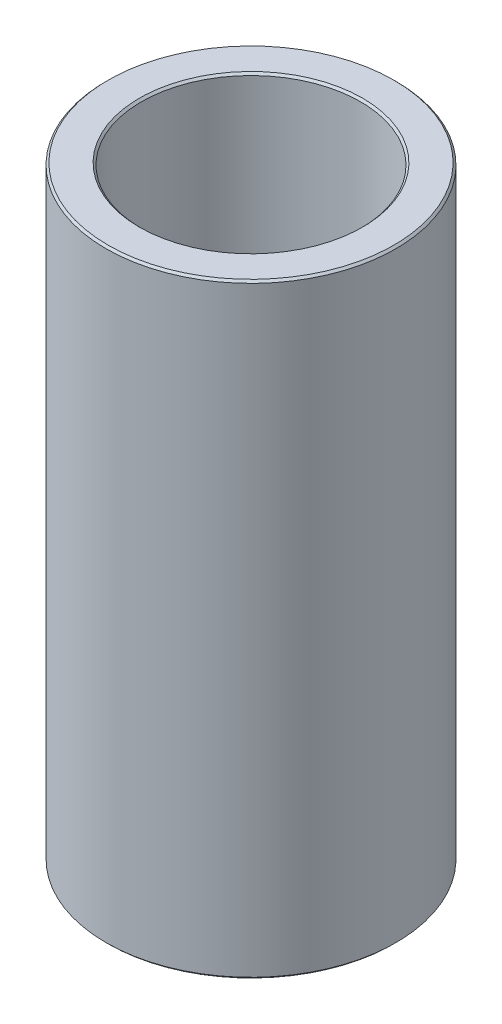
ISO-10303-21;
HEADER;
FILE_DESCRIPTION(('STEP AP214'),'2;1');
FILE_NAME('part.step','',(''),(''),'','','');
FILE_SCHEMA(('AUTOMOTIVE_DESIGN { 1 0 10303 214 1 1 1 1 }'));
ENDSEC;
DATA;
#1=APPLICATION_CONTEXT('core data for automotive mechanical design processes');
#2=APPLICATION_PROTOCOL_DEFINITION('international standard','automotive_design',2000,#1);
#3=PRODUCT_CONTEXT('',#1,'mechanical');
#4=PRODUCT('Part','Part','',(#3));
#5=PRODUCT_RELATED_PRODUCT_CATEGORY('part','',(#4));
#6=PRODUCT_DEFINITION_FORMATION('','',#4);
#7=PRODUCT_DEFINITION_CONTEXT('part definition',#1,'design');
#8=PRODUCT_DEFINITION('design','',#6,#7);
#9=PRODUCT_DEFINITION_SHAPE('','',#8);
#10=(LENGTH_UNIT() NAMED_UNIT(*) SI_UNIT(.MILLI.,.METRE.));
#11=(NAMED_UNIT(*) PLANE_ANGLE_UNIT() SI_UNIT($,.RADIAN.));
#12=(NAMED_UNIT(*) SI_UNIT($,.STERADIAN.) SOLID_ANGLE_UNIT());
#13=UNCERTAINTY_MEASURE_WITH_UNIT(LENGTH_MEASURE(1.E-05),#10,'distance_accuracy_value','');
#14=(GEOMETRIC_REPRESENTATION_CONTEXT(3) GLOBAL_UNCERTAINTY_ASSIGNED_CONTEXT((#13)) GLOBAL_UNIT_ASSIGNED_CONTEXT((#10,
#11,#12)) REPRESENTATION_CONTEXT('',''));
#15=CARTESIAN_POINT('',(0.,0.,0.));
#16=DIRECTION('',(0.,0.,1.));
#17=DIRECTION('',(1.,0.,0.));
#18=AXIS2_PLACEMENT_3D('',#15,#16,#17);
#19=CARTESIAN_POINT('',(0.,219.13131283102,0.));
#20=DIRECTION('',(0.,-1.,0.));
#21=DIRECTION('',(0.,0.,-1.));
#22=AXIS2_PLACEMENT_3D('',#19,#20,#21);
#23=CYLINDRICAL_SURFACE('',#22,52.5);
#24=CARTESIAN_POINT('',(0.,0.743105318616905,0.));
#25=DIRECTION('',(0.,1.,0.));
#26=DIRECTION('',(0.,0.,1.));
#27=AXIS2_PLACEMENT_3D('',#24,#25,#26);
#28=CIRCLE('',#27,52.5);
#29=CARTESIAN_POINT('',(0.,0.743105318616905,52.5));
#30=VERTEX_POINT('',#29);
#31=EDGE_CURVE('E10',#30,#30,#28,.T.);
#32=ORIENTED_EDGE('',*,*,#31,.T.);
#33=EDGE_LOOP('',(#32));
#34=FACE_BOUND('',#33,.T.);
#35=CARTESIAN_POINT('',(0.,218.388207512403,0.));
#36=DIRECTION('',(0.,1.,0.));
#37=DIRECTION('',(0.,0.,1.));
#38=AXIS2_PLACEMENT_3D('',#35,#36,#37);
#39=CIRCLE('',#38,52.5);
#40=CARTESIAN_POINT('',(0.,218.388207512403,-52.5));
#41=VERTEX_POINT('',#40);
#42=EDGE_CURVE('E50',#41,#41,#39,.F.);
#43=ORIENTED_EDGE('',*,*,#42,.T.);
#44=EDGE_LOOP('',(#43));
#45=FACE_BOUND('',#44,.T.);
#46=ADVANCED_FACE('F39',(#34,#45),#23,.T.);
#47=CARTESIAN_POINT('',(0.,219.13131283102,0.));
#48=DIRECTION('',(0.,1.,0.));
#49=DIRECTION('',(0.,0.,1.));
#50=AXIS2_PLACEMENT_3D('',#47,#48,#49);
#51=PLANE('',#50);
#52=CARTESIAN_POINT('',(0.,219.13131283102,0.));
#53=DIRECTION('',(0.,1.,0.));
#54=DIRECTION('',(0.,0.,1.));
#55=AXIS2_PLACEMENT_3D('',#52,#53,#54);
#56=CIRCLE('',#55,40.4467173957197);
#57=CARTESIAN_POINT('',(0.,219.13131283102,40.4467173957197));
#58=VERTEX_POINT('',#57);
#59=EDGE_CURVE('E58',#58,#58,#56,.F.);
#60=ORIENTED_EDGE('',*,*,#59,.T.);
#61=EDGE_LOOP('',(#60));
#62=FACE_BOUND('',#61,.T.);
#63=CARTESIAN_POINT('',(0.,219.13131283102,0.));
#64=DIRECTION('',(0.,1.,0.));
#65=DIRECTION('',(0.,0.,1.));
#66=AXIS2_PLACEMENT_3D('',#63,#64,#65);
#67=CIRCLE('',#66,51.7568946813831);
#68=CARTESIAN_POINT('',(0.,219.13131283102,-51.7568946813831));
#69=VERTEX_POINT('',#68);
#70=EDGE_CURVE('E61',#69,#69,#67,.T.);
#71=ORIENTED_EDGE('',*,*,#70,.T.);
#72=EDGE_LOOP('',(#71));
#73=FACE_BOUND('',#72,.T.);
#74=ADVANCED_FACE('F88',(#62,#73),#51,.T.);
#75=CARTESIAN_POINT('',(0.,0.,0.));
#76=DIRECTION('',(0.,1.,0.));
#77=DIRECTION('',(0.,0.,1.));
#78=AXIS2_PLACEMENT_3D('',#75,#76,#77);
#79=PLANE('',#78);
#80=CARTESIAN_POINT('',(0.,0.,0.));
#81=DIRECTION('',(0.,1.,0.));
#82=DIRECTION('',(0.,0.,1.));
#83=AXIS2_PLACEMENT_3D('',#80,#81,#82);
#84=CIRCLE('',#83,40.4467173957197);
#85=CARTESIAN_POINT('',(0.,0.,40.4467173957197));
#86=VERTEX_POINT('',#85);
#87=EDGE_CURVE('E51',#86,#86,#84,.T.);
#88=ORIENTED_EDGE('',*,*,#87,.T.);
#89=EDGE_LOOP('',(#88));
#90=FACE_BOUND('',#89,.T.);
#91=CARTESIAN_POINT('',(0.,0.,0.));
#92=DIRECTION('',(0.,1.,0.));
#93=DIRECTION('',(0.,0.,1.));
#94=AXIS2_PLACEMENT_3D('',#91,#92,#93);
#95=CIRCLE('',#94,51.7568946813831);
#96=CARTESIAN_POINT('',(0.,0.,51.7568946813831));
#97=VERTEX_POINT('',#96);
#98=EDGE_CURVE('E54',#97,#97,#95,.F.);
#99=ORIENTED_EDGE('',*,*,#98,.T.);
#100=EDGE_LOOP('',(#99));
#101=FACE_BOUND('',#100,.T.);
#102=ADVANCED_FACE('F83',(#90,#101),#79,.F.);
#103=CARTESIAN_POINT('',(0.,219.13131283102,0.));
#104=DIRECTION('',(0.,-1.,0.));
#105=DIRECTION('',(0.,0.,-1.));
#106=AXIS2_PLACEMENT_3D('',#103,#104,#105);
#107=CYLINDRICAL_SURFACE('',#106,39.7036120771028);
#108=CARTESIAN_POINT('',(0.,218.388207512403,0.));
#109=DIRECTION('',(0.,1.,0.));
#110=DIRECTION('',(0.,0.,1.));
#111=AXIS2_PLACEMENT_3D('',#108,#109,#110);
#112=CIRCLE('',#111,39.7036120771028);
#113=CARTESIAN_POINT('',(0.,218.388207512403,39.7036120771028));
#114=VERTEX_POINT('',#113);
#115=EDGE_CURVE('E67',#114,#114,#112,.T.);
#116=ORIENTED_EDGE('',*,*,#115,.T.);
#117=EDGE_LOOP('',(#116));
#118=FACE_BOUND('',#117,.T.);
#119=CARTESIAN_POINT('',(0.,0.743105318616905,0.));
#120=DIRECTION('',(0.,1.,0.));
#121=DIRECTION('',(0.,0.,1.));
#122=AXIS2_PLACEMENT_3D('',#119,#120,#121);
#123=CIRCLE('',#122,39.7036120771028);
#124=CARTESIAN_POINT('',(0.,0.743105318616905,39.7036120771028));
#125=VERTEX_POINT('',#124);
#126=EDGE_CURVE('E69',#125,#125,#123,.F.);
#127=ORIENTED_EDGE('',*,*,#126,.T.);
#128=EDGE_LOOP('',(#127));
#129=FACE_BOUND('',#128,.T.);
#130=ADVANCED_FACE('F71',(#118,#129),#107,.F.);
#131=CARTESIAN_POINT('',(0.,218.388207512403,0.));
#132=DIRECTION('',(0.,1.,0.));
#133=DIRECTION('',(0.,0.,1.));
#134=AXIS2_PLACEMENT_3D('',#131,#132,#133);
#135=CONICAL_SURFACE('',#134,39.7036120771028,0.785398163397453);
#136=CARTESIAN_POINT('',(0.,219.13131283102,40.4467173957197));
#137=CARTESIAN_POINT('',(0.,219.123572150618,40.4389767153174));
#138=CARTESIAN_POINT('',(0.,219.115831470216,40.4312360349152));
#139=CARTESIAN_POINT('',(0.,219.100350109411,40.4157546741106));
#140=CARTESIAN_POINT('',(0.,219.092609429009,40.4080139937084));
#141=CARTESIAN_POINT('',(0.,219.077128068204,40.3925326329039));
#142=CARTESIAN_POINT('',(0.,219.069387387802,40.3847919525016));
#143=CARTESIAN_POINT('',(0.,219.053906026998,40.3693105916971));
#144=CARTESIAN_POINT('',(0.,219.046165346595,40.3615699112948));
#145=CARTESIAN_POINT('',(0.,219.030683985791,40.3460885504903));
#146=CARTESIAN_POINT('',(0.,219.022943305389,40.3383478700881));
#147=CARTESIAN_POINT('',(0.,219.007461944584,40.3228665092835));
#148=CARTESIAN_POINT('',(0.,218.999721264182,40.3151258288813));
#149=CARTESIAN_POINT('',(0.,218.984239903377,40.2996444680768));
#150=CARTESIAN_POINT('',(0.,218.976499222975,40.2919037876745));
#151=CARTESIAN_POINT('',(0.,218.96101786217,40.27642242687));
#152=CARTESIAN_POINT('',(0.,218.953277181768,40.2686817464677));
#153=CARTESIAN_POINT('',(0.,218.937795820964,40.2532003856632));
#154=CARTESIAN_POINT('',(0.,218.930055140561,40.2454597052609));
#155=CARTESIAN_POINT('',(0.,218.914573779757,40.2299783444564));
#156=CARTESIAN_POINT('',(0.,218.906833099355,40.2222376640542));
#157=CARTESIAN_POINT('',(0.,218.89135173855,40.2067563032496));
#158=CARTESIAN_POINT('',(0.,218.883611058148,40.1990156228474));
#159=CARTESIAN_POINT('',(0.,218.868129697343,40.1835342620429));
#160=CARTESIAN_POINT('',(0.,218.860389016941,40.1757935816406));
#161=CARTESIAN_POINT('',(0.,218.844907656137,40.1603122208361));
#162=CARTESIAN_POINT('',(0.,218.837166975734,40.1525715404338));
#163=CARTESIAN_POINT('',(0.,218.82168561493,40.1370901796293));
#164=CARTESIAN_POINT('',(0.,218.813944934528,40.1293494992271));
#165=CARTESIAN_POINT('',(0.,218.798463573723,40.1138681384225));
#166=CARTESIAN_POINT('',(0.,218.790722893321,40.1061274580203));
#167=CARTESIAN_POINT('',(0.,218.775241532516,40.0906460972158));
#168=CARTESIAN_POINT('',(0.,218.767500852114,40.0829054168135));
#169=CARTESIAN_POINT('',(0.,218.752019491309,40.067424056009));
#170=CARTESIAN_POINT('',(0.,218.744278810907,40.0596833756067));
#171=CARTESIAN_POINT('',(0.,218.728797450103,40.0442020148022));
#172=CARTESIAN_POINT('',(0.,218.7210567697,40.0364613343999));
#173=CARTESIAN_POINT('',(0.,218.705575408896,40.0209799735954));
#174=CARTESIAN_POINT('',(0.,218.697834728494,40.0132392931932));
#175=CARTESIAN_POINT('',(0.,218.682353367689,39.9977579323886));
#176=CARTESIAN_POINT('',(0.,218.674612687287,39.9900172519864));
#177=CARTESIAN_POINT('',(0.,218.659131326482,39.9745358911819));
#178=CARTESIAN_POINT('',(0.,218.65139064608,39.9667952107796));
#179=CARTESIAN_POINT('',(0.,218.635909285276,39.9513138499751));
#180=CARTESIAN_POINT('',(0.,218.628168604873,39.9435731695728));
#181=CARTESIAN_POINT('',(0.,218.612687244069,39.9280918087683));
#182=CARTESIAN_POINT('',(0.,218.604946563667,39.9203511283661));
#183=CARTESIAN_POINT('',(0.,218.589465202862,39.9048697675615));
#184=CARTESIAN_POINT('',(0.,218.58172452246,39.8971290871593));
#185=CARTESIAN_POINT('',(0.,218.566243161655,39.8816477263548));
#186=CARTESIAN_POINT('',(0.,218.558502481253,39.8739070459525));
#187=CARTESIAN_POINT('',(0.,218.543021120448,39.858425685148));
#188=CARTESIAN_POINT('',(0.,218.535280440046,39.8506850047457));
#189=CARTESIAN_POINT('',(0.,218.519799079242,39.8352036439412));
#190=CARTESIAN_POINT('',(0.,218.512058398839,39.8274629635389));
#191=CARTESIAN_POINT('',(0.,218.496577038035,39.8119816027344));
#192=CARTESIAN_POINT('',(0.,218.488836357633,39.8042409223322));
#193=CARTESIAN_POINT('',(0.,218.473354996828,39.7887595615276));
#194=CARTESIAN_POINT('',(0.,218.465614316426,39.7810188811254));
#195=CARTESIAN_POINT('',(0.,218.450132955621,39.7655375203209));
#196=CARTESIAN_POINT('',(0.,218.442392275219,39.7577968399186));
#197=CARTESIAN_POINT('',(0.,218.426910914415,39.7423154791141));
#198=CARTESIAN_POINT('',(0.,218.419170234012,39.7345747987118));
#199=CARTESIAN_POINT('',(0.,218.403688873208,39.7190934379073));
#200=CARTESIAN_POINT('',(0.,218.395948192806,39.7113527575051));
#201=CARTESIAN_POINT('',(0.,218.388207512403,39.7036120771028));
#202=B_SPLINE_CURVE_WITH_KNOTS('',3,(#136,#137,#138,#139,#140,#141,#142,#143,#144,#145,#146,
#147,#148,#149,#150,#151,#152,#153,#154,#155,#156,#157,#158,#159,#160,#161,#162,#163,#164,#165,
#166,#167,#168,#169,#170,#171,#172,#173,#174,#175,#176,#177,#178,#179,#180,#181,#182,#183,#184,
#185,#186,#187,#188,#189,#190,#191,#192,#193,#194,#195,#196,#197,#198,#199,#200,#201),
.UNSPECIFIED.,.F.,.F.,(4,2,2,2,2,2,2,2,2,2,2,2,2,2,2,2,2,2,2,2,2,2,2,2,2,2,2,2,2,2,2,2,4),(0.,
0.0328409256206115,0.0656818512412229,0.0985227768618344,0.131363702482446,0.164204628103057,
0.197045553723669,0.22988647934428,0.262727404964892,0.295568330585503,0.328409256206115,
0.361250181826726,0.394091107447338,0.426932033067949,0.459772958688561,0.492613884309172,
0.525454809929784,0.5582957355504,0.591136661171011,0.623977586791623,0.656818512412234,
0.689659438032846,0.722500363653457,0.755341289274069,0.78818221489468,0.821023140515291,
0.853864066135903,0.886704991756514,0.919545917377126,0.952386842997737,0.985227768618349,
1.01806869423896,1.05090961985955),.UNSPECIFIED.);
#203=EDGE_CURVE('BSEAM77',#58,#114,#202,.T.);
#204=ORIENTED_EDGE('',*,*,#59,.F.);
#205=ORIENTED_EDGE('',*,*,#115,.F.);
#206=ORIENTED_EDGE('',*,*,#203,.T.);
#207=ORIENTED_EDGE('',*,*,#203,.F.);
#208=EDGE_LOOP('',(#204,#206,#205,#207));
#209=FACE_BOUND('',#208,.T.);
#210=ADVANCED_FACE('F77',(#209),#135,.F.);
#211=CARTESIAN_POINT('',(0.,0.,0.));
#212=DIRECTION('',(0.,-1.,0.));
#213=DIRECTION('',(0.,0.,-1.));
#214=AXIS2_PLACEMENT_3D('',#211,#212,#213);
#215=CONICAL_SURFACE('',#214,40.4467173957197,0.785398163397453);
#216=ORIENTED_EDGE('',*,*,#126,.F.);
#217=EDGE_LOOP('',(#216));
#218=FACE_BOUND('',#217,.T.);
#219=ORIENTED_EDGE('',*,*,#87,.F.);
#220=EDGE_LOOP('',(#219));
#221=FACE_BOUND('',#220,.T.);
#222=ADVANCED_FACE('F73',(#218,#221),#215,.F.);
#223=CARTESIAN_POINT('',(0.,0.743105318616905,0.));
#224=DIRECTION('',(0.,1.,0.));
#225=DIRECTION('',(0.,0.,1.));
#226=AXIS2_PLACEMENT_3D('',#223,#224,#225);
#227=CONICAL_SURFACE('',#226,52.5,0.785398163397434);
#228=ORIENTED_EDGE('',*,*,#98,.F.);
#229=EDGE_LOOP('',(#228));
#230=FACE_BOUND('',#229,.T.);
#231=ORIENTED_EDGE('',*,*,#31,.F.);
#232=EDGE_LOOP('',(#231));
#233=FACE_BOUND('',#232,.T.);
#234=ADVANCED_FACE('F76',(#230,#233),#227,.T.);
#235=CARTESIAN_POINT('',(0.,219.13131283102,0.));
#236=DIRECTION('',(0.,-1.,0.));
#237=DIRECTION('',(0.,0.,-1.));
#238=AXIS2_PLACEMENT_3D('',#235,#236,#237);
#239=CONICAL_SURFACE('',#238,51.7568946813831,0.785398163397448);
#240=CARTESIAN_POINT('',(0.,218.388207512403,-52.5));
#241=CARTESIAN_POINT('',(0.,218.395948192806,-52.4922593195977));
#242=CARTESIAN_POINT('',(0.,218.403688873208,-52.4845186391955));
#243=CARTESIAN_POINT('',(0.,218.419170234012,-52.469037278391));
#244=CARTESIAN_POINT('',(0.,218.426910914415,-52.4612965979887));
#245=CARTESIAN_POINT('',(0.,218.442392275219,-52.4458152371842));
#246=CARTESIAN_POINT('',(0.,218.450132955621,-52.4380745567819));
#247=CARTESIAN_POINT('',(0.,218.465614316426,-52.4225931959774));
#248=CARTESIAN_POINT('',(0.,218.473354996828,-52.4148525155752));
#249=CARTESIAN_POINT('',(0.,218.488836357633,-52.3993711547706));
#250=CARTESIAN_POINT('',(0.,218.496577038035,-52.3916304743684));
#251=CARTESIAN_POINT('',(0.,218.512058398839,-52.3761491135639));
#252=CARTESIAN_POINT('',(0.,218.519799079242,-52.3684084331616));
#253=CARTESIAN_POINT('',(0.,218.535280440046,-52.3529270723571));
#254=CARTESIAN_POINT('',(0.,218.543021120448,-52.3451863919548));
#255=CARTESIAN_POINT('',(0.,218.558502481253,-52.3297050311503));
#256=CARTESIAN_POINT('',(0.,218.566243161655,-52.3219643507481));
#257=CARTESIAN_POINT('',(0.,218.58172452246,-52.3064829899435));
#258=CARTESIAN_POINT('',(0.,218.589465202862,-52.2987423095413));
#259=CARTESIAN_POINT('',(0.,218.604946563667,-52.2832609487368));
#260=CARTESIAN_POINT('',(0.,218.612687244069,-52.2755202683345));
#261=CARTESIAN_POINT('',(0.,218.628168604873,-52.26003890753));
#262=CARTESIAN_POINT('',(0.,218.635909285276,-52.2522982271277));
#263=CARTESIAN_POINT('',(0.,218.65139064608,-52.2368168663232));
#264=CARTESIAN_POINT('',(0.,218.659131326482,-52.2290761859209));
#265=CARTESIAN_POINT('',(0.,218.674612687287,-52.2135948251164));
#266=CARTESIAN_POINT('',(0.,218.682353367689,-52.2058541447142));
#267=CARTESIAN_POINT('',(0.,218.697834728494,-52.1903727839096));
#268=CARTESIAN_POINT('',(0.,218.705575408896,-52.1826321035074));
#269=CARTESIAN_POINT('',(0.,218.7210567697,-52.1671507427029));
#270=CARTESIAN_POINT('',(0.,218.728797450103,-52.1594100623006));
#271=CARTESIAN_POINT('',(0.,218.744278810907,-52.1439287014961));
#272=CARTESIAN_POINT('',(0.,218.752019491309,-52.1361880210938));
#273=CARTESIAN_POINT('',(0.,218.767500852114,-52.1207066602893));
#274=CARTESIAN_POINT('',(0.,218.775241532516,-52.1129659798871));
#275=CARTESIAN_POINT('',(0.,218.790722893321,-52.0974846190825));
#276=CARTESIAN_POINT('',(0.,218.798463573723,-52.0897439386803));
#277=CARTESIAN_POINT('',(0.,218.813944934528,-52.0742625778758));
#278=CARTESIAN_POINT('',(0.,218.82168561493,-52.0665218974735));
#279=CARTESIAN_POINT('',(0.,218.837166975734,-52.051040536669));
#280=CARTESIAN_POINT('',(0.,218.844907656137,-52.0432998562667));
#281=CARTESIAN_POINT('',(0.,218.860389016941,-52.0278184954622));
#282=CARTESIAN_POINT('',(0.,218.868129697343,-52.0200778150599));
#283=CARTESIAN_POINT('',(0.,218.883611058148,-52.0045964542554));
#284=CARTESIAN_POINT('',(0.,218.89135173855,-51.9968557738532));
#285=CARTESIAN_POINT('',(0.,218.906833099355,-51.9813744130486));
#286=CARTESIAN_POINT('',(0.,218.914573779757,-51.9736337326464));
#287=CARTESIAN_POINT('',(0.,218.930055140561,-51.9581523718419));
#288=CARTESIAN_POINT('',(0.,218.937795820964,-51.9504116914396));
#289=CARTESIAN_POINT('',(0.,218.953277181768,-51.9349303306351));
#290=CARTESIAN_POINT('',(0.,218.961017862171,-51.9271896502328));
#291=CARTESIAN_POINT('',(0.,218.976499222975,-51.9117082894283));
#292=CARTESIAN_POINT('',(0.,218.984239903377,-51.9039676090261));
#293=CARTESIAN_POINT('',(0.,218.999721264182,-51.8884862482215));
#294=CARTESIAN_POINT('',(0.,219.007461944584,-51.8807455678193));
#295=CARTESIAN_POINT('',(0.,219.022943305389,-51.8652642070148));
#296=CARTESIAN_POINT('',(0.,219.030683985791,-51.8575235266125));
#297=CARTESIAN_POINT('',(0.,219.046165346595,-51.842042165808));
#298=CARTESIAN_POINT('',(0.,219.053906026998,-51.8343014854057));
#299=CARTESIAN_POINT('',(0.,219.069387387802,-51.8188201246012));
#300=CARTESIAN_POINT('',(0.,219.077128068204,-51.811079444199));
#301=CARTESIAN_POINT('',(0.,219.092609429009,-51.7955980833944));
#302=CARTESIAN_POINT('',(0.,219.100350109411,-51.7878574029922));
#303=CARTESIAN_POINT('',(0.,219.115831470216,-51.7723760421877));
#304=CARTESIAN_POINT('',(0.,219.123572150618,-51.7646353617854));
#305=CARTESIAN_POINT('',(0.,219.13131283102,-51.7568946813831));
#306=B_SPLINE_CURVE_WITH_KNOTS('',3,(#240,#241,#242,#243,#244,#245,#246,#247,#248,#249,#250,
#251,#252,#253,#254,#255,#256,#257,#258,#259,#260,#261,#262,#263,#264,#265,#266,#267,#268,#269,
#270,#271,#272,#273,#274,#275,#276,#277,#278,#279,#280,#281,#282,#283,#284,#285,#286,#287,#288,
#289,#290,#291,#292,#293,#294,#295,#296,#297,#298,#299,#300,#301,#302,#303,#304,#305),
.UNSPECIFIED.,.F.,.F.,(4,2,2,2,2,2,2,2,2,2,2,2,2,2,2,2,2,2,2,2,2,2,2,2,2,2,2,2,2,2,2,2,4),(0.,
0.0328409256206115,0.0656818512412229,0.0985227768618344,0.131363702482446,0.164204628103057,
0.197045553723669,0.22988647934428,0.262727404964892,0.295568330585503,0.328409256206115,
0.361250181826726,0.394091107447338,0.426932033067949,0.459772958688561,0.492613884309172,
0.525454809929784,0.558295735550395,0.591136661171006,0.623977586791618,0.656818512412229,
0.689659438032841,0.722500363653452,0.755341289274064,0.788182214894695,0.821023140515306,
0.853864066135917,0.886704991756529,0.91954591737714,0.952386842997752,0.985227768618363,
1.01806869423897,1.05090961985959),.UNSPECIFIED.);
#307=EDGE_CURVE('BSEAM45',#41,#69,#306,.T.);
#308=ORIENTED_EDGE('',*,*,#42,.F.);
#309=ORIENTED_EDGE('',*,*,#70,.F.);
#310=ORIENTED_EDGE('',*,*,#307,.T.);
#311=ORIENTED_EDGE('',*,*,#307,.F.);
#312=EDGE_LOOP('',(#308,#310,#309,#311));
#313=FACE_BOUND('',#312,.T.);
#314=ADVANCED_FACE('F45',(#313),#239,.T.);
#315=CLOSED_SHELL('',(#46,#74,#102,#130,#210,#222,#234,#314));
#316=MANIFOLD_SOLID_BREP('B2',#315);
#317=ADVANCED_BREP_SHAPE_REPRESENTATION('',(#18,#316),#14);
#318=SHAPE_DEFINITION_REPRESENTATION(#9,#317);
ENDSEC;
END-ISO-10303-21;
